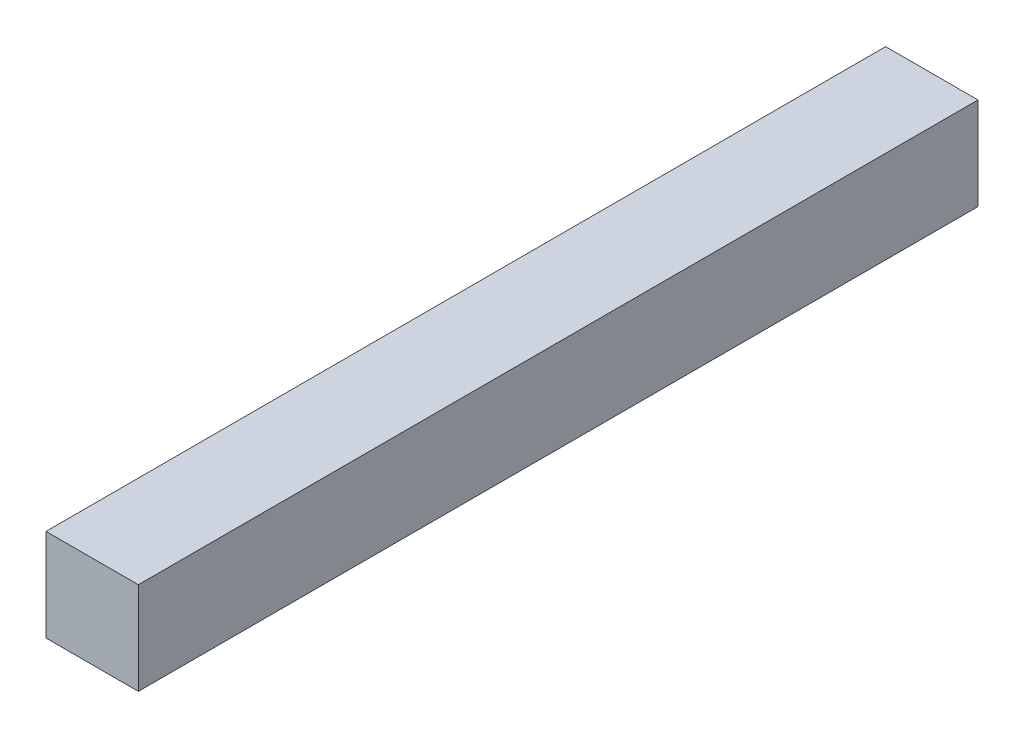
ISO-10303-21;
HEADER;
FILE_DESCRIPTION(('STEP AP214'),'2;1');
FILE_NAME('part.step','',(''),(''),'','','');
FILE_SCHEMA(('AUTOMOTIVE_DESIGN { 1 0 10303 214 1 1 1 1 }'));
ENDSEC;
DATA;
#1=APPLICATION_CONTEXT('core data for automotive mechanical design processes');
#2=APPLICATION_PROTOCOL_DEFINITION('international standard','automotive_design',2000,#1);
#3=PRODUCT_CONTEXT('',#1,'mechanical');
#4=PRODUCT('Part','Part','',(#3));
#5=PRODUCT_RELATED_PRODUCT_CATEGORY('part','',(#4));
#6=PRODUCT_DEFINITION_FORMATION('','',#4);
#7=PRODUCT_DEFINITION_CONTEXT('part definition',#1,'design');
#8=PRODUCT_DEFINITION('design','',#6,#7);
#9=PRODUCT_DEFINITION_SHAPE('','',#8);
#10=(LENGTH_UNIT() NAMED_UNIT(*) SI_UNIT(.MILLI.,.METRE.));
#11=(NAMED_UNIT(*) PLANE_ANGLE_UNIT() SI_UNIT($,.RADIAN.));
#12=(NAMED_UNIT(*) SI_UNIT($,.STERADIAN.) SOLID_ANGLE_UNIT());
#13=UNCERTAINTY_MEASURE_WITH_UNIT(LENGTH_MEASURE(1.E-05),#10,'distance_accuracy_value','');
#14=(GEOMETRIC_REPRESENTATION_CONTEXT(3) GLOBAL_UNCERTAINTY_ASSIGNED_CONTEXT((#13)) GLOBAL_UNIT_ASSIGNED_CONTEXT((#10,
#11,#12)) REPRESENTATION_CONTEXT('',''));
#15=CARTESIAN_POINT('',(0.,0.,0.));
#16=DIRECTION('',(0.,0.,1.));
#17=DIRECTION('',(1.,0.,0.));
#18=AXIS2_PLACEMENT_3D('',#15,#16,#17);
#19=CARTESIAN_POINT('',(-11.,11.,0.));
#20=DIRECTION('',(-1.,0.,0.));
#21=DIRECTION('',(0.,0.,1.));
#22=AXIS2_PLACEMENT_3D('',#19,#20,#21);
#23=PLANE('',#22);
#24=DIRECTION('',(0.,1.,0.));
#25=VECTOR('',#24,1.);
#26=CARTESIAN_POINT('',(-11.,0.,200.));
#27=LINE('',#26,#25);
#28=CARTESIAN_POINT('',(-11.,11.,200.));
#29=VERTEX_POINT('',#28);
#30=CARTESIAN_POINT('',(-11.,-11.,200.));
#31=VERTEX_POINT('',#30);
#32=EDGE_CURVE('E68',#29,#31,#27,.F.);
#33=ORIENTED_EDGE('',*,*,#32,.F.);
#34=DIRECTION('',(0.,0.,1.));
#35=VECTOR('',#34,1.);
#36=CARTESIAN_POINT('',(-11.,11.,0.));
#37=LINE('',#36,#35);
#38=CARTESIAN_POINT('',(-11.,11.,0.));
#39=VERTEX_POINT('',#38);
#40=EDGE_CURVE('E55',#39,#29,#37,.T.);
#41=ORIENTED_EDGE('',*,*,#40,.F.);
#42=DIRECTION('',(0.,1.,0.));
#43=VECTOR('',#42,1.);
#44=CARTESIAN_POINT('',(-11.,0.,0.));
#45=LINE('',#44,#43);
#46=CARTESIAN_POINT('',(-11.,-11.,0.));
#47=VERTEX_POINT('',#46);
#48=EDGE_CURVE('E20',#39,#47,#45,.F.);
#49=ORIENTED_EDGE('',*,*,#48,.T.);
#50=DIRECTION('',(0.,0.,-1.));
#51=VECTOR('',#50,1.);
#52=CARTESIAN_POINT('',(-11.,-11.,0.));
#53=LINE('',#52,#51);
#54=EDGE_CURVE('E81',#31,#47,#53,.T.);
#55=ORIENTED_EDGE('',*,*,#54,.F.);
#56=EDGE_LOOP('',(#33,#41,#49,#55));
#57=FACE_BOUND('',#56,.T.);
#58=ADVANCED_FACE('F17',(#57),#23,.T.);
#59=CARTESIAN_POINT('',(0.,0.,0.));
#60=DIRECTION('',(0.,0.,1.));
#61=DIRECTION('',(1.,0.,0.));
#62=AXIS2_PLACEMENT_3D('',#59,#60,#61);
#63=PLANE('',#62);
#64=DIRECTION('',(0.,1.,0.));
#65=VECTOR('',#64,1.);
#66=CARTESIAN_POINT('',(11.,-11.,0.));
#67=LINE('',#66,#65);
#68=CARTESIAN_POINT('',(11.,-11.,0.));
#69=VERTEX_POINT('',#68);
#70=CARTESIAN_POINT('',(11.,11.,0.));
#71=VERTEX_POINT('',#70);
#72=EDGE_CURVE('E83',#69,#71,#67,.T.);
#73=ORIENTED_EDGE('',*,*,#72,.F.);
#74=DIRECTION('',(1.,0.,0.));
#75=VECTOR('',#74,1.);
#76=CARTESIAN_POINT('',(-11.,-11.,0.));
#77=LINE('',#76,#75);
#78=EDGE_CURVE('E64',#47,#69,#77,.T.);
#79=ORIENTED_EDGE('',*,*,#78,.F.);
#80=ORIENTED_EDGE('',*,*,#48,.F.);
#81=DIRECTION('',(1.,0.,0.));
#82=VECTOR('',#81,1.);
#83=CARTESIAN_POINT('',(11.,11.,0.));
#84=LINE('',#83,#82);
#85=EDGE_CURVE('E61',#71,#39,#84,.F.);
#86=ORIENTED_EDGE('',*,*,#85,.F.);
#87=EDGE_LOOP('',(#73,#79,#80,#86));
#88=FACE_BOUND('',#87,.T.);
#89=ADVANCED_FACE('F60',(#88),#63,.F.);
#90=CARTESIAN_POINT('',(11.,11.,0.));
#91=DIRECTION('',(0.,1.,0.));
#92=DIRECTION('',(0.,0.,1.));
#93=AXIS2_PLACEMENT_3D('',#90,#91,#92);
#94=PLANE('',#93);
#95=DIRECTION('',(1.,0.,0.));
#96=VECTOR('',#95,1.);
#97=CARTESIAN_POINT('',(0.,11.,200.));
#98=LINE('',#97,#96);
#99=CARTESIAN_POINT('',(11.,11.,200.));
#100=VERTEX_POINT('',#99);
#101=EDGE_CURVE('E70',#100,#29,#98,.F.);
#102=ORIENTED_EDGE('',*,*,#101,.F.);
#103=DIRECTION('',(0.,0.,1.));
#104=VECTOR('',#103,1.);
#105=CARTESIAN_POINT('',(11.,11.,0.));
#106=LINE('',#105,#104);
#107=EDGE_CURVE('E74',#71,#100,#106,.T.);
#108=ORIENTED_EDGE('',*,*,#107,.F.);
#109=ORIENTED_EDGE('',*,*,#85,.T.);
#110=ORIENTED_EDGE('',*,*,#40,.T.);
#111=EDGE_LOOP('',(#102,#108,#109,#110));
#112=FACE_BOUND('',#111,.T.);
#113=ADVANCED_FACE('F72',(#112),#94,.T.);
#114=CARTESIAN_POINT('',(0.,0.,200.));
#115=DIRECTION('',(0.,0.,1.));
#116=DIRECTION('',(1.,0.,0.));
#117=AXIS2_PLACEMENT_3D('',#114,#115,#116);
#118=PLANE('',#117);
#119=DIRECTION('',(1.,0.,0.));
#120=VECTOR('',#119,1.);
#121=CARTESIAN_POINT('',(-11.,-11.,200.));
#122=LINE('',#121,#120);
#123=CARTESIAN_POINT('',(11.,-11.,200.));
#124=VERTEX_POINT('',#123);
#125=EDGE_CURVE('E35',#124,#31,#122,.F.);
#126=ORIENTED_EDGE('',*,*,#125,.F.);
#127=DIRECTION('',(0.,1.,0.));
#128=VECTOR('',#127,1.);
#129=CARTESIAN_POINT('',(11.,-11.,200.));
#130=LINE('',#129,#128);
#131=EDGE_CURVE('E26',#100,#124,#130,.F.);
#132=ORIENTED_EDGE('',*,*,#131,.F.);
#133=ORIENTED_EDGE('',*,*,#101,.T.);
#134=ORIENTED_EDGE('',*,*,#32,.T.);
#135=EDGE_LOOP('',(#126,#132,#133,#134));
#136=FACE_BOUND('',#135,.T.);
#137=ADVANCED_FACE('F89',(#136),#118,.T.);
#138=CARTESIAN_POINT('',(-11.,-11.,0.));
#139=DIRECTION('',(0.,-1.,0.));
#140=DIRECTION('',(0.,0.,-1.));
#141=AXIS2_PLACEMENT_3D('',#138,#139,#140);
#142=PLANE('',#141);
#143=ORIENTED_EDGE('',*,*,#125,.T.);
#144=ORIENTED_EDGE('',*,*,#54,.T.);
#145=ORIENTED_EDGE('',*,*,#78,.T.);
#146=DIRECTION('',(0.,0.,1.));
#147=VECTOR('',#146,1.);
#148=CARTESIAN_POINT('',(11.,-11.,0.));
#149=LINE('',#148,#147);
#150=EDGE_CURVE('E11',#124,#69,#149,.F.);
#151=ORIENTED_EDGE('',*,*,#150,.F.);
#152=EDGE_LOOP('',(#143,#144,#145,#151));
#153=FACE_BOUND('',#152,.T.);
#154=ADVANCED_FACE('F91',(#153),#142,.T.);
#155=CARTESIAN_POINT('',(11.,-11.,0.));
#156=DIRECTION('',(1.,0.,0.));
#157=DIRECTION('',(0.,1.,0.));
#158=AXIS2_PLACEMENT_3D('',#155,#156,#157);
#159=PLANE('',#158);
#160=ORIENTED_EDGE('',*,*,#131,.T.);
#161=ORIENTED_EDGE('',*,*,#150,.T.);
#162=ORIENTED_EDGE('',*,*,#72,.T.);
#163=ORIENTED_EDGE('',*,*,#107,.T.);
#164=EDGE_LOOP('',(#160,#161,#162,#163));
#165=FACE_BOUND('',#164,.T.);
#166=ADVANCED_FACE('F88',(#165),#159,.T.);
#167=CLOSED_SHELL('',(#58,#89,#113,#137,#154,#166));
#168=MANIFOLD_SOLID_BREP('B1',#167);
#169=ADVANCED_BREP_SHAPE_REPRESENTATION('',(#18,#168),#14);
#170=SHAPE_DEFINITION_REPRESENTATION(#9,#169);
ENDSEC;
END-ISO-10303-21;
